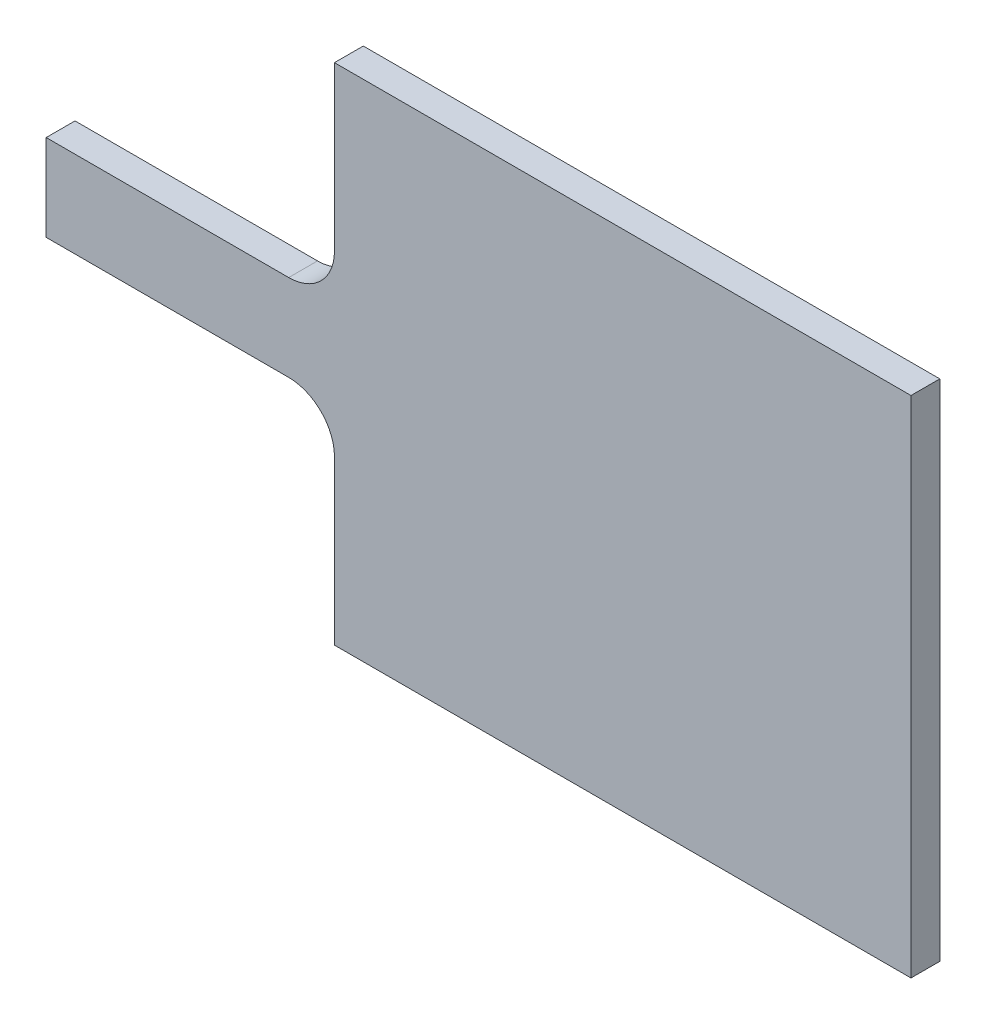
ISO-10303-21;
HEADER;
FILE_DESCRIPTION(('STEP AP214'),'2;1');
FILE_NAME('part.step','',(''),(''),'','','');
FILE_SCHEMA(('AUTOMOTIVE_DESIGN { 1 0 10303 214 1 1 1 1 }'));
ENDSEC;
DATA;
#1=APPLICATION_CONTEXT('core data for automotive mechanical design processes');
#2=APPLICATION_PROTOCOL_DEFINITION('international standard','automotive_design',2000,#1);
#3=PRODUCT_CONTEXT('',#1,'mechanical');
#4=PRODUCT('Part','Part','',(#3));
#5=PRODUCT_RELATED_PRODUCT_CATEGORY('part','',(#4));
#6=PRODUCT_DEFINITION_FORMATION('','',#4);
#7=PRODUCT_DEFINITION_CONTEXT('part definition',#1,'design');
#8=PRODUCT_DEFINITION('design','',#6,#7);
#9=PRODUCT_DEFINITION_SHAPE('','',#8);
#10=(LENGTH_UNIT() NAMED_UNIT(*) SI_UNIT(.MILLI.,.METRE.));
#11=(NAMED_UNIT(*) PLANE_ANGLE_UNIT() SI_UNIT($,.RADIAN.));
#12=(NAMED_UNIT(*) SI_UNIT($,.STERADIAN.) SOLID_ANGLE_UNIT());
#13=UNCERTAINTY_MEASURE_WITH_UNIT(LENGTH_MEASURE(1.E-05),#10,'distance_accuracy_value','');
#14=(GEOMETRIC_REPRESENTATION_CONTEXT(3) GLOBAL_UNCERTAINTY_ASSIGNED_CONTEXT((#13)) GLOBAL_UNIT_ASSIGNED_CONTEXT((#10,
#11,#12)) REPRESENTATION_CONTEXT('',''));
#15=CARTESIAN_POINT('',(0.,0.,0.));
#16=DIRECTION('',(0.,0.,1.));
#17=DIRECTION('',(1.,0.,0.));
#18=AXIS2_PLACEMENT_3D('',#15,#16,#17);
#19=CARTESIAN_POINT('',(0.,0.,1.));
#20=DIRECTION('',(1.,0.,0.));
#21=DIRECTION('',(0.,0.,-1.));
#22=AXIS2_PLACEMENT_3D('',#19,#20,#21);
#23=PLANE('',#22);
#24=DIRECTION('',(0.,-1.,0.));
#25=VECTOR('',#24,1.);
#26=CARTESIAN_POINT('',(0.,0.,0.));
#27=LINE('',#26,#25);
#28=CARTESIAN_POINT('',(0.,5.66249999999999,0.));
#29=VERTEX_POINT('',#28);
#30=CARTESIAN_POINT('',(0.,0.,0.));
#31=VERTEX_POINT('',#30);
#32=EDGE_CURVE('E153',#29,#31,#27,.T.);
#33=ORIENTED_EDGE('',*,*,#32,.T.);
#34=DIRECTION('',(0.,0.,-1.));
#35=VECTOR('',#34,1.);
#36=CARTESIAN_POINT('',(0.,0.,1.));
#37=LINE('',#36,#35);
#38=CARTESIAN_POINT('',(0.,0.,1.));
#39=VERTEX_POINT('',#38);
#40=EDGE_CURVE('E11',#39,#31,#37,.T.);
#41=ORIENTED_EDGE('',*,*,#40,.F.);
#42=DIRECTION('',(0.,-1.,0.));
#43=VECTOR('',#42,1.);
#44=CARTESIAN_POINT('',(0.,0.,1.));
#45=LINE('',#44,#43);
#46=CARTESIAN_POINT('',(0.,5.66249999999999,1.));
#47=VERTEX_POINT('',#46);
#48=EDGE_CURVE('E180',#47,#39,#45,.T.);
#49=ORIENTED_EDGE('',*,*,#48,.F.);
#50=DIRECTION('',(0.,0.,-1.));
#51=VECTOR('',#50,1.);
#52=CARTESIAN_POINT('',(0.,5.66249999999999,1.));
#53=LINE('',#52,#51);
#54=EDGE_CURVE('E149',#47,#29,#53,.T.);
#55=ORIENTED_EDGE('',*,*,#54,.T.);
#56=EDGE_LOOP('',(#33,#41,#49,#55));
#57=FACE_BOUND('',#56,.T.);
#58=ADVANCED_FACE('F38',(#57),#23,.F.);
#59=CARTESIAN_POINT('',(0.,0.,1.));
#60=DIRECTION('',(0.,1.,0.));
#61=DIRECTION('',(0.,0.,1.));
#62=AXIS2_PLACEMENT_3D('',#59,#60,#61);
#63=PLANE('',#62);
#64=DIRECTION('',(1.,0.,0.));
#65=VECTOR('',#64,1.);
#66=CARTESIAN_POINT('',(0.,0.,0.));
#67=LINE('',#66,#65);
#68=CARTESIAN_POINT('',(20.,0.,0.));
#69=VERTEX_POINT('',#68);
#70=EDGE_CURVE('E157',#31,#69,#67,.T.);
#71=ORIENTED_EDGE('',*,*,#70,.T.);
#72=DIRECTION('',(0.,0.,-1.));
#73=VECTOR('',#72,1.);
#74=CARTESIAN_POINT('',(20.,0.,1.));
#75=LINE('',#74,#73);
#76=CARTESIAN_POINT('',(20.,0.,1.));
#77=VERTEX_POINT('',#76);
#78=EDGE_CURVE('E47',#77,#69,#75,.T.);
#79=ORIENTED_EDGE('',*,*,#78,.F.);
#80=DIRECTION('',(1.,0.,0.));
#81=VECTOR('',#80,1.);
#82=CARTESIAN_POINT('',(0.,0.,1.));
#83=LINE('',#82,#81);
#84=EDGE_CURVE('E104',#39,#77,#83,.T.);
#85=ORIENTED_EDGE('',*,*,#84,.F.);
#86=ORIENTED_EDGE('',*,*,#40,.T.);
#87=EDGE_LOOP('',(#71,#79,#85,#86));
#88=FACE_BOUND('',#87,.T.);
#89=ADVANCED_FACE('F243',(#88),#63,.F.);
#90=CARTESIAN_POINT('',(20.,0.,1.));
#91=DIRECTION('',(-1.,0.,0.));
#92=DIRECTION('',(0.,0.,1.));
#93=AXIS2_PLACEMENT_3D('',#90,#91,#92);
#94=PLANE('',#93);
#95=DIRECTION('',(0.,1.,0.));
#96=VECTOR('',#95,1.);
#97=CARTESIAN_POINT('',(20.,0.,0.));
#98=LINE('',#97,#96);
#99=CARTESIAN_POINT('',(20.,17.5,0.));
#100=VERTEX_POINT('',#99);
#101=EDGE_CURVE('E160',#69,#100,#98,.T.);
#102=ORIENTED_EDGE('',*,*,#101,.T.);
#103=DIRECTION('',(0.,0.,-1.));
#104=VECTOR('',#103,1.);
#105=CARTESIAN_POINT('',(20.,17.5,1.));
#106=LINE('',#105,#104);
#107=CARTESIAN_POINT('',(20.,17.5,1.));
#108=VERTEX_POINT('',#107);
#109=EDGE_CURVE('E199',#108,#100,#106,.T.);
#110=ORIENTED_EDGE('',*,*,#109,.F.);
#111=DIRECTION('',(0.,1.,0.));
#112=VECTOR('',#111,1.);
#113=CARTESIAN_POINT('',(20.,0.,1.));
#114=LINE('',#113,#112);
#115=EDGE_CURVE('E210',#77,#108,#114,.T.);
#116=ORIENTED_EDGE('',*,*,#115,.F.);
#117=ORIENTED_EDGE('',*,*,#78,.T.);
#118=EDGE_LOOP('',(#102,#110,#116,#117));
#119=FACE_BOUND('',#118,.T.);
#120=ADVANCED_FACE('F208',(#119),#94,.F.);
#121=CARTESIAN_POINT('',(0.,17.5,1.));
#122=DIRECTION('',(0.,-1.,0.));
#123=DIRECTION('',(0.,0.,-1.));
#124=AXIS2_PLACEMENT_3D('',#121,#122,#123);
#125=PLANE('',#124);
#126=DIRECTION('',(-1.,0.,0.));
#127=VECTOR('',#126,1.);
#128=CARTESIAN_POINT('',(0.,17.5,0.));
#129=LINE('',#128,#127);
#130=CARTESIAN_POINT('',(0.,17.5,0.));
#131=VERTEX_POINT('',#130);
#132=EDGE_CURVE('E163',#100,#131,#129,.T.);
#133=ORIENTED_EDGE('',*,*,#132,.T.);
#134=DIRECTION('',(0.,0.,-1.));
#135=VECTOR('',#134,1.);
#136=CARTESIAN_POINT('',(0.,17.5,1.));
#137=LINE('',#136,#135);
#138=CARTESIAN_POINT('',(0.,17.5,1.));
#139=VERTEX_POINT('',#138);
#140=EDGE_CURVE('E195',#139,#131,#137,.T.);
#141=ORIENTED_EDGE('',*,*,#140,.F.);
#142=DIRECTION('',(-1.,0.,0.));
#143=VECTOR('',#142,1.);
#144=CARTESIAN_POINT('',(0.,17.5,1.));
#145=LINE('',#144,#143);
#146=EDGE_CURVE('E229',#108,#139,#145,.T.);
#147=ORIENTED_EDGE('',*,*,#146,.F.);
#148=ORIENTED_EDGE('',*,*,#109,.T.);
#149=EDGE_LOOP('',(#133,#141,#147,#148));
#150=FACE_BOUND('',#149,.T.);
#151=ADVANCED_FACE('F219',(#150),#125,.F.);
#152=CARTESIAN_POINT('',(0.,11.8375,1.));
#153=DIRECTION('',(1.,0.,0.));
#154=DIRECTION('',(0.,0.,-1.));
#155=AXIS2_PLACEMENT_3D('',#152,#153,#154);
#156=PLANE('',#155);
#157=DIRECTION('',(0.,-1.,0.));
#158=VECTOR('',#157,1.);
#159=CARTESIAN_POINT('',(0.,11.8375,0.));
#160=LINE('',#159,#158);
#161=CARTESIAN_POINT('',(0.,11.8375,0.));
#162=VERTEX_POINT('',#161);
#163=EDGE_CURVE('E166',#131,#162,#160,.T.);
#164=ORIENTED_EDGE('',*,*,#163,.T.);
#165=DIRECTION('',(0.,0.,-1.));
#166=VECTOR('',#165,1.);
#167=CARTESIAN_POINT('',(0.,11.8375,1.));
#168=LINE('',#167,#166);
#169=CARTESIAN_POINT('',(0.,11.8375,1.));
#170=VERTEX_POINT('',#169);
#171=EDGE_CURVE('E191',#170,#162,#168,.T.);
#172=ORIENTED_EDGE('',*,*,#171,.F.);
#173=DIRECTION('',(0.,-1.,0.));
#174=VECTOR('',#173,1.);
#175=CARTESIAN_POINT('',(0.,11.8375,1.));
#176=LINE('',#175,#174);
#177=EDGE_CURVE('E225',#139,#170,#176,.T.);
#178=ORIENTED_EDGE('',*,*,#177,.F.);
#179=ORIENTED_EDGE('',*,*,#140,.T.);
#180=EDGE_LOOP('',(#164,#172,#178,#179));
#181=FACE_BOUND('',#180,.T.);
#182=ADVANCED_FACE('F223',(#181),#156,.F.);
#183=CARTESIAN_POINT('',(-1.5875,11.8375,1.));
#184=DIRECTION('',(0.,0.,-1.));
#185=DIRECTION('',(-1.,0.,0.));
#186=AXIS2_PLACEMENT_3D('',#183,#184,#185);
#187=CYLINDRICAL_SURFACE('',#186,1.5875);
#188=CARTESIAN_POINT('',(-1.5875,11.8375,0.));
#189=DIRECTION('',(0.,0.,-1.));
#190=DIRECTION('',(1.,0.,0.));
#191=AXIS2_PLACEMENT_3D('',#188,#189,#190);
#192=CIRCLE('',#191,1.5875);
#193=CARTESIAN_POINT('',(-1.58750000000001,10.25,0.));
#194=VERTEX_POINT('',#193);
#195=EDGE_CURVE('E169',#162,#194,#192,.T.);
#196=ORIENTED_EDGE('',*,*,#195,.T.);
#197=DIRECTION('',(0.,0.,-1.));
#198=VECTOR('',#197,1.);
#199=CARTESIAN_POINT('',(-1.58750000000001,10.25,1.));
#200=LINE('',#199,#198);
#201=CARTESIAN_POINT('',(-1.58750000000001,10.25,1.));
#202=VERTEX_POINT('',#201);
#203=EDGE_CURVE('E187',#202,#194,#200,.T.);
#204=ORIENTED_EDGE('',*,*,#203,.F.);
#205=CARTESIAN_POINT('',(-1.5875,11.8375,1.));
#206=DIRECTION('',(0.,0.,-1.));
#207=DIRECTION('',(1.,0.,0.));
#208=AXIS2_PLACEMENT_3D('',#205,#206,#207);
#209=CIRCLE('',#208,1.5875);
#210=EDGE_CURVE('E228',#170,#202,#209,.T.);
#211=ORIENTED_EDGE('',*,*,#210,.F.);
#212=ORIENTED_EDGE('',*,*,#171,.T.);
#213=EDGE_LOOP('',(#196,#204,#211,#212));
#214=FACE_BOUND('',#213,.T.);
#215=ADVANCED_FACE('F255',(#214),#187,.F.);
#216=CARTESIAN_POINT('',(-1.58750000000001,10.25,1.));
#217=DIRECTION('',(0.,-1.,0.));
#218=DIRECTION('',(0.,0.,-1.));
#219=AXIS2_PLACEMENT_3D('',#216,#217,#218);
#220=PLANE('',#219);
#221=DIRECTION('',(-1.,0.,0.));
#222=VECTOR('',#221,1.);
#223=CARTESIAN_POINT('',(-1.58750000000001,10.25,0.));
#224=LINE('',#223,#222);
#225=CARTESIAN_POINT('',(-10.,10.25,0.));
#226=VERTEX_POINT('',#225);
#227=EDGE_CURVE('E172',#194,#226,#224,.T.);
#228=ORIENTED_EDGE('',*,*,#227,.T.);
#229=DIRECTION('',(0.,0.,-1.));
#230=VECTOR('',#229,1.);
#231=CARTESIAN_POINT('',(-10.,10.25,1.));
#232=LINE('',#231,#230);
#233=CARTESIAN_POINT('',(-10.,10.25,1.));
#234=VERTEX_POINT('',#233);
#235=EDGE_CURVE('E140',#234,#226,#232,.T.);
#236=ORIENTED_EDGE('',*,*,#235,.F.);
#237=DIRECTION('',(-1.,0.,0.));
#238=VECTOR('',#237,1.);
#239=CARTESIAN_POINT('',(-1.58750000000001,10.25,1.));
#240=LINE('',#239,#238);
#241=EDGE_CURVE('E129',#202,#234,#240,.T.);
#242=ORIENTED_EDGE('',*,*,#241,.F.);
#243=ORIENTED_EDGE('',*,*,#203,.T.);
#244=EDGE_LOOP('',(#228,#236,#242,#243));
#245=FACE_BOUND('',#244,.T.);
#246=ADVANCED_FACE('F258',(#245),#220,.F.);
#247=CARTESIAN_POINT('',(-10.,10.25,1.));
#248=DIRECTION('',(1.,0.,0.));
#249=DIRECTION('',(0.,0.,-1.));
#250=AXIS2_PLACEMENT_3D('',#247,#248,#249);
#251=PLANE('',#250);
#252=DIRECTION('',(0.,-1.,0.));
#253=VECTOR('',#252,1.);
#254=CARTESIAN_POINT('',(-10.,10.25,0.));
#255=LINE('',#254,#253);
#256=CARTESIAN_POINT('',(-10.,7.25,0.));
#257=VERTEX_POINT('',#256);
#258=EDGE_CURVE('E138',#226,#257,#255,.T.);
#259=ORIENTED_EDGE('',*,*,#258,.T.);
#260=DIRECTION('',(0.,0.,-1.));
#261=VECTOR('',#260,1.);
#262=CARTESIAN_POINT('',(-10.,7.25,1.));
#263=LINE('',#262,#261);
#264=CARTESIAN_POINT('',(-10.,7.25,1.));
#265=VERTEX_POINT('',#264);
#266=EDGE_CURVE('E135',#265,#257,#263,.T.);
#267=ORIENTED_EDGE('',*,*,#266,.F.);
#268=DIRECTION('',(0.,-1.,0.));
#269=VECTOR('',#268,1.);
#270=CARTESIAN_POINT('',(-10.,10.25,1.));
#271=LINE('',#270,#269);
#272=EDGE_CURVE('E123',#234,#265,#271,.T.);
#273=ORIENTED_EDGE('',*,*,#272,.F.);
#274=ORIENTED_EDGE('',*,*,#235,.T.);
#275=EDGE_LOOP('',(#259,#267,#273,#274));
#276=FACE_BOUND('',#275,.T.);
#277=ADVANCED_FACE('F136',(#276),#251,.F.);
#278=CARTESIAN_POINT('',(-1.58750000000001,7.25,1.));
#279=DIRECTION('',(0.,1.,0.));
#280=DIRECTION('',(0.,0.,1.));
#281=AXIS2_PLACEMENT_3D('',#278,#279,#280);
#282=PLANE('',#281);
#283=DIRECTION('',(1.,0.,0.));
#284=VECTOR('',#283,1.);
#285=CARTESIAN_POINT('',(-1.58750000000001,7.25,0.));
#286=LINE('',#285,#284);
#287=CARTESIAN_POINT('',(-1.58750000000001,7.25,0.));
#288=VERTEX_POINT('',#287);
#289=EDGE_CURVE('E90',#257,#288,#286,.T.);
#290=ORIENTED_EDGE('',*,*,#289,.T.);
#291=DIRECTION('',(0.,0.,-1.));
#292=VECTOR('',#291,1.);
#293=CARTESIAN_POINT('',(-1.58750000000001,7.25,1.));
#294=LINE('',#293,#292);
#295=CARTESIAN_POINT('',(-1.58750000000001,7.25,1.));
#296=VERTEX_POINT('',#295);
#297=EDGE_CURVE('E141',#296,#288,#294,.T.);
#298=ORIENTED_EDGE('',*,*,#297,.F.);
#299=DIRECTION('',(1.,0.,0.));
#300=VECTOR('',#299,1.);
#301=CARTESIAN_POINT('',(-1.58750000000001,7.25,1.));
#302=LINE('',#301,#300);
#303=EDGE_CURVE('E127',#265,#296,#302,.T.);
#304=ORIENTED_EDGE('',*,*,#303,.F.);
#305=ORIENTED_EDGE('',*,*,#266,.T.);
#306=EDGE_LOOP('',(#290,#298,#304,#305));
#307=FACE_BOUND('',#306,.T.);
#308=ADVANCED_FACE('F143',(#307),#282,.F.);
#309=CARTESIAN_POINT('',(-1.5875,5.6625,1.));
#310=DIRECTION('',(0.,0.,-1.));
#311=DIRECTION('',(-1.,0.,0.));
#312=AXIS2_PLACEMENT_3D('',#309,#310,#311);
#313=CYLINDRICAL_SURFACE('',#312,1.5875);
#314=CARTESIAN_POINT('',(-1.5875,5.6625,0.));
#315=DIRECTION('',(0.,0.,-1.));
#316=DIRECTION('',(1.,0.,0.));
#317=AXIS2_PLACEMENT_3D('',#314,#315,#316);
#318=CIRCLE('',#317,1.5875);
#319=EDGE_CURVE('E96',#288,#29,#318,.T.);
#320=ORIENTED_EDGE('',*,*,#319,.T.);
#321=ORIENTED_EDGE('',*,*,#54,.F.);
#322=CARTESIAN_POINT('',(-1.5875,5.6625,1.));
#323=DIRECTION('',(0.,0.,-1.));
#324=DIRECTION('',(1.,0.,0.));
#325=AXIS2_PLACEMENT_3D('',#322,#323,#324);
#326=CIRCLE('',#325,1.5875);
#327=EDGE_CURVE('E55',#296,#47,#326,.T.);
#328=ORIENTED_EDGE('',*,*,#327,.F.);
#329=ORIENTED_EDGE('',*,*,#297,.T.);
#330=EDGE_LOOP('',(#320,#321,#328,#329));
#331=FACE_BOUND('',#330,.T.);
#332=ADVANCED_FACE('F267',(#331),#313,.F.);
#333=CARTESIAN_POINT('',(-1.5875,5.6625,1.));
#334=DIRECTION('',(0.,0.,1.));
#335=DIRECTION('',(1.,0.,0.));
#336=AXIS2_PLACEMENT_3D('',#333,#334,#335);
#337=PLANE('',#336);
#338=ORIENTED_EDGE('',*,*,#48,.T.);
#339=ORIENTED_EDGE('',*,*,#84,.T.);
#340=ORIENTED_EDGE('',*,*,#115,.T.);
#341=ORIENTED_EDGE('',*,*,#146,.T.);
#342=ORIENTED_EDGE('',*,*,#177,.T.);
#343=ORIENTED_EDGE('',*,*,#210,.T.);
#344=ORIENTED_EDGE('',*,*,#241,.T.);
#345=ORIENTED_EDGE('',*,*,#272,.T.);
#346=ORIENTED_EDGE('',*,*,#303,.T.);
#347=ORIENTED_EDGE('',*,*,#327,.T.);
#348=EDGE_LOOP('',(#338,#339,#340,#341,#342,#343,#344,#345,#346,#347));
#349=FACE_BOUND('',#348,.T.);
#350=ADVANCED_FACE('F125',(#349),#337,.T.);
#351=CARTESIAN_POINT('',(-1.5875,5.6625,0.));
#352=DIRECTION('',(0.,0.,1.));
#353=DIRECTION('',(1.,0.,0.));
#354=AXIS2_PLACEMENT_3D('',#351,#352,#353);
#355=PLANE('',#354);
#356=ORIENTED_EDGE('',*,*,#32,.F.);
#357=ORIENTED_EDGE('',*,*,#319,.F.);
#358=ORIENTED_EDGE('',*,*,#289,.F.);
#359=ORIENTED_EDGE('',*,*,#258,.F.);
#360=ORIENTED_EDGE('',*,*,#227,.F.);
#361=ORIENTED_EDGE('',*,*,#195,.F.);
#362=ORIENTED_EDGE('',*,*,#163,.F.);
#363=ORIENTED_EDGE('',*,*,#132,.F.);
#364=ORIENTED_EDGE('',*,*,#101,.F.);
#365=ORIENTED_EDGE('',*,*,#70,.F.);
#366=EDGE_LOOP('',(#356,#357,#358,#359,#360,#361,#362,#363,#364,#365));
#367=FACE_BOUND('',#366,.T.);
#368=ADVANCED_FACE('F214',(#367),#355,.F.);
#369=CLOSED_SHELL('',(#58,#89,#120,#151,#182,#215,#246,#277,#308,#332,#350,#368));
#370=MANIFOLD_SOLID_BREP('B2',#369);
#371=ADVANCED_BREP_SHAPE_REPRESENTATION('',(#18,#370),#14);
#372=SHAPE_DEFINITION_REPRESENTATION(#9,#371);
ENDSEC;
END-ISO-10303-21;
